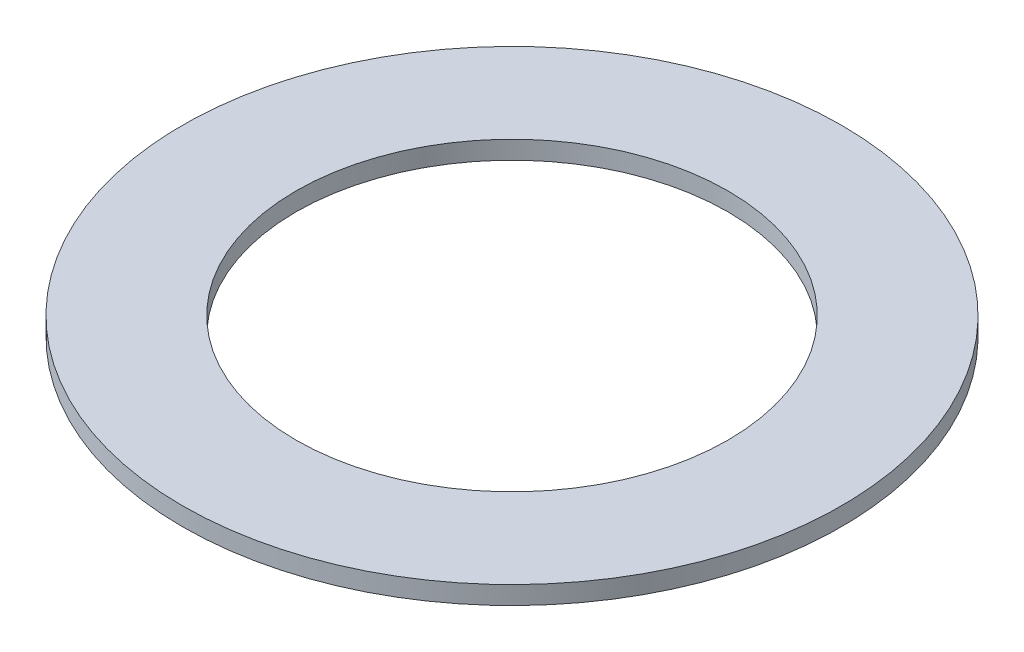
ISO-10303-21;
HEADER;
FILE_DESCRIPTION(('STEP AP214'),'2;1');
FILE_NAME('part.step','',(''),(''),'','','');
FILE_SCHEMA(('AUTOMOTIVE_DESIGN { 1 0 10303 214 1 1 1 1 }'));
ENDSEC;
DATA;
#1=APPLICATION_CONTEXT('core data for automotive mechanical design processes');
#2=APPLICATION_PROTOCOL_DEFINITION('international standard','automotive_design',2000,#1);
#3=PRODUCT_CONTEXT('',#1,'mechanical');
#4=PRODUCT('Part','Part','',(#3));
#5=PRODUCT_RELATED_PRODUCT_CATEGORY('part','',(#4));
#6=PRODUCT_DEFINITION_FORMATION('','',#4);
#7=PRODUCT_DEFINITION_CONTEXT('part definition',#1,'design');
#8=PRODUCT_DEFINITION('design','',#6,#7);
#9=PRODUCT_DEFINITION_SHAPE('','',#8);
#10=(LENGTH_UNIT() NAMED_UNIT(*) SI_UNIT(.MILLI.,.METRE.));
#11=(NAMED_UNIT(*) PLANE_ANGLE_UNIT() SI_UNIT($,.RADIAN.));
#12=(NAMED_UNIT(*) SI_UNIT($,.STERADIAN.) SOLID_ANGLE_UNIT());
#13=UNCERTAINTY_MEASURE_WITH_UNIT(LENGTH_MEASURE(1.E-05),#10,'distance_accuracy_value','');
#14=(GEOMETRIC_REPRESENTATION_CONTEXT(3) GLOBAL_UNCERTAINTY_ASSIGNED_CONTEXT((#13)) GLOBAL_UNIT_ASSIGNED_CONTEXT((#10,
#11,#12)) REPRESENTATION_CONTEXT('',''));
#15=CARTESIAN_POINT('',(0.,0.,0.));
#16=DIRECTION('',(0.,0.,1.));
#17=DIRECTION('',(1.,0.,0.));
#18=AXIS2_PLACEMENT_3D('',#15,#16,#17);
#19=CARTESIAN_POINT('',(0.,4.,0.));
#20=DIRECTION('',(0.,-1.,0.));
#21=DIRECTION('',(0.,0.,-1.));
#22=AXIS2_PLACEMENT_3D('',#19,#20,#21);
#23=CYLINDRICAL_SURFACE('',#22,72.5);
#24=CARTESIAN_POINT('',(0.,4.,0.));
#25=DIRECTION('',(0.,1.,0.));
#26=DIRECTION('',(0.,0.,1.));
#27=AXIS2_PLACEMENT_3D('',#24,#25,#26);
#28=CIRCLE('',#27,72.5);
#29=CARTESIAN_POINT('',(0.,4.,72.5));
#30=VERTEX_POINT('',#29);
#31=EDGE_CURVE('E10',#30,#30,#28,.T.);
#32=ORIENTED_EDGE('',*,*,#31,.F.);
#33=EDGE_LOOP('',(#32));
#34=FACE_BOUND('',#33,.T.);
#35=CARTESIAN_POINT('',(0.,0.,0.));
#36=DIRECTION('',(0.,1.,0.));
#37=DIRECTION('',(0.,0.,1.));
#38=AXIS2_PLACEMENT_3D('',#35,#36,#37);
#39=CIRCLE('',#38,72.5);
#40=CARTESIAN_POINT('',(0.,0.,72.5));
#41=VERTEX_POINT('',#40);
#42=EDGE_CURVE('E37',#41,#41,#39,.T.);
#43=ORIENTED_EDGE('',*,*,#42,.T.);
#44=EDGE_LOOP('',(#43));
#45=FACE_BOUND('',#44,.T.);
#46=ADVANCED_FACE('F40',(#34,#45),#23,.T.);
#47=CARTESIAN_POINT('',(0.,4.,0.));
#48=DIRECTION('',(0.,1.,0.));
#49=DIRECTION('',(0.,0.,1.));
#50=AXIS2_PLACEMENT_3D('',#47,#48,#49);
#51=PLANE('',#50);
#52=CARTESIAN_POINT('',(0.,4.,0.));
#53=DIRECTION('',(0.,1.,0.));
#54=DIRECTION('',(0.,0.,1.));
#55=AXIS2_PLACEMENT_3D('',#52,#53,#54);
#56=CIRCLE('',#55,47.5);
#57=CARTESIAN_POINT('',(0.,4.,47.5));
#58=VERTEX_POINT('',#57);
#59=EDGE_CURVE('E50',#58,#58,#56,.T.);
#60=ORIENTED_EDGE('',*,*,#59,.F.);
#61=EDGE_LOOP('',(#60));
#62=FACE_BOUND('',#61,.T.);
#63=ORIENTED_EDGE('',*,*,#31,.T.);
#64=EDGE_LOOP('',(#63));
#65=FACE_BOUND('',#64,.T.);
#66=ADVANCED_FACE('F59',(#62,#65),#51,.T.);
#67=CARTESIAN_POINT('',(0.,0.,0.));
#68=DIRECTION('',(0.,1.,0.));
#69=DIRECTION('',(0.,0.,1.));
#70=AXIS2_PLACEMENT_3D('',#67,#68,#69);
#71=PLANE('',#70);
#72=CARTESIAN_POINT('',(0.,0.,0.));
#73=DIRECTION('',(0.,1.,0.));
#74=DIRECTION('',(0.,0.,1.));
#75=AXIS2_PLACEMENT_3D('',#72,#73,#74);
#76=CIRCLE('',#75,47.5);
#77=CARTESIAN_POINT('',(0.,0.,47.5));
#78=VERTEX_POINT('',#77);
#79=EDGE_CURVE('E47',#78,#78,#76,.T.);
#80=ORIENTED_EDGE('',*,*,#79,.T.);
#81=EDGE_LOOP('',(#80));
#82=FACE_BOUND('',#81,.T.);
#83=ORIENTED_EDGE('',*,*,#42,.F.);
#84=EDGE_LOOP('',(#83));
#85=FACE_BOUND('',#84,.T.);
#86=ADVANCED_FACE('F58',(#82,#85),#71,.F.);
#87=CARTESIAN_POINT('',(0.,4.,0.));
#88=DIRECTION('',(0.,-1.,0.));
#89=DIRECTION('',(0.,0.,-1.));
#90=AXIS2_PLACEMENT_3D('',#87,#88,#89);
#91=CYLINDRICAL_SURFACE('',#90,47.5);
#92=ORIENTED_EDGE('',*,*,#59,.T.);
#93=EDGE_LOOP('',(#92));
#94=FACE_BOUND('',#93,.T.);
#95=ORIENTED_EDGE('',*,*,#79,.F.);
#96=EDGE_LOOP('',(#95));
#97=FACE_BOUND('',#96,.T.);
#98=ADVANCED_FACE('F54',(#94,#97),#91,.F.);
#99=CLOSED_SHELL('',(#46,#66,#86,#98));
#100=MANIFOLD_SOLID_BREP('B2',#99);
#101=ADVANCED_BREP_SHAPE_REPRESENTATION('',(#18,#100),#14);
#102=SHAPE_DEFINITION_REPRESENTATION(#9,#101);
ENDSEC;
END-ISO-10303-21;
